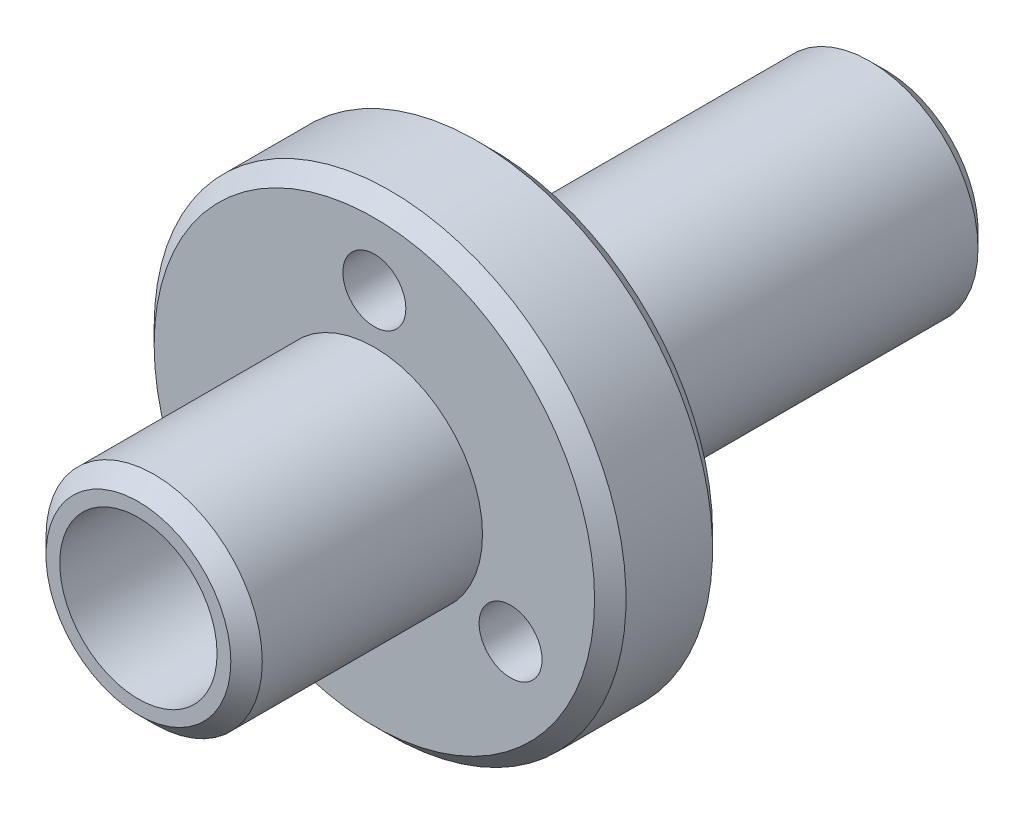
ISO-10303-21;
HEADER;
FILE_DESCRIPTION(('STEP AP214'),'2;1');
FILE_NAME('part.step','',(''),(''),'','','');
FILE_SCHEMA(('AUTOMOTIVE_DESIGN { 1 0 10303 214 1 1 1 1 }'));
ENDSEC;
DATA;
#1=APPLICATION_CONTEXT('core data for automotive mechanical design processes');
#2=APPLICATION_PROTOCOL_DEFINITION('international standard','automotive_design',2000,#1);
#3=PRODUCT_CONTEXT('',#1,'mechanical');
#4=PRODUCT('Part','Part','',(#3));
#5=PRODUCT_RELATED_PRODUCT_CATEGORY('part','',(#4));
#6=PRODUCT_DEFINITION_FORMATION('','',#4);
#7=PRODUCT_DEFINITION_CONTEXT('part definition',#1,'design');
#8=PRODUCT_DEFINITION('design','',#6,#7);
#9=PRODUCT_DEFINITION_SHAPE('','',#8);
#10=(LENGTH_UNIT() NAMED_UNIT(*) SI_UNIT(.MILLI.,.METRE.));
#11=(NAMED_UNIT(*) PLANE_ANGLE_UNIT() SI_UNIT($,.RADIAN.));
#12=(NAMED_UNIT(*) SI_UNIT($,.STERADIAN.) SOLID_ANGLE_UNIT());
#13=UNCERTAINTY_MEASURE_WITH_UNIT(LENGTH_MEASURE(1.E-05),#10,'distance_accuracy_value','');
#14=(GEOMETRIC_REPRESENTATION_CONTEXT(3) GLOBAL_UNCERTAINTY_ASSIGNED_CONTEXT((#13)) GLOBAL_UNIT_ASSIGNED_CONTEXT((#10,
#11,#12)) REPRESENTATION_CONTEXT('',''));
#15=CARTESIAN_POINT('',(0.,0.,0.));
#16=DIRECTION('',(0.,0.,1.));
#17=DIRECTION('',(1.,0.,0.));
#18=AXIS2_PLACEMENT_3D('',#15,#16,#17);
#19=CARTESIAN_POINT('',(-27.5,59.9979166304964,-6.));
#20=DIRECTION('',(0.,0.,1.));
#21=DIRECTION('',(1.,0.,0.));
#22=AXIS2_PLACEMENT_3D('',#19,#20,#21);
#23=CYLINDRICAL_SURFACE('',#22,2.75);
#24=CARTESIAN_POINT('',(-27.5,59.9979166304964,-0.399999999999998));
#25=DIRECTION('',(0.,0.,1.));
#26=DIRECTION('',(1.,0.,0.));
#27=AXIS2_PLACEMENT_3D('',#24,#25,#26);
#28=CIRCLE('',#27,2.75);
#29=CARTESIAN_POINT('',(-24.75,59.9979166304964,-0.399999999999998));
#30=VERTEX_POINT('',#29);
#31=EDGE_CURVE('E66',#30,#30,#28,.F.);
#32=ORIENTED_EDGE('',*,*,#31,.T.);
#33=EDGE_LOOP('',(#32));
#34=FACE_BOUND('',#33,.T.);
#35=CARTESIAN_POINT('',(-27.5,59.9979166304964,-6.));
#36=DIRECTION('',(0.,0.,1.));
#37=DIRECTION('',(1.,0.,0.));
#38=AXIS2_PLACEMENT_3D('',#35,#36,#37);
#39=CIRCLE('',#38,2.75);
#40=CARTESIAN_POINT('',(-24.75,59.9979166304964,-6.));
#41=VERTEX_POINT('',#40);
#42=EDGE_CURVE('E95',#41,#41,#39,.T.);
#43=ORIENTED_EDGE('',*,*,#42,.T.);
#44=EDGE_LOOP('',(#43));
#45=FACE_BOUND('',#44,.T.);
#46=ADVANCED_FACE('F39',(#34,#45),#23,.T.);
#47=CARTESIAN_POINT('',(-27.5,59.9979166304964,0.));
#48=DIRECTION('',(0.,0.,1.));
#49=DIRECTION('',(1.,0.,0.));
#50=AXIS2_PLACEMENT_3D('',#47,#48,#49);
#51=PLANE('',#50);
#52=CARTESIAN_POINT('',(-27.5,59.9979166304964,0.));
#53=DIRECTION('',(0.,0.,1.));
#54=DIRECTION('',(1.,0.,0.));
#55=AXIS2_PLACEMENT_3D('',#52,#53,#54);
#56=CIRCLE('',#55,2.);
#57=CARTESIAN_POINT('',(-25.5,59.9979166304964,0.));
#58=VERTEX_POINT('',#57);
#59=EDGE_CURVE('E109',#58,#58,#56,.T.);
#60=ORIENTED_EDGE('',*,*,#59,.F.);
#61=EDGE_LOOP('',(#60));
#62=FACE_BOUND('',#61,.T.);
#63=CARTESIAN_POINT('',(-27.5,59.9979166304964,0.));
#64=DIRECTION('',(0.,0.,1.));
#65=DIRECTION('',(1.,0.,0.));
#66=AXIS2_PLACEMENT_3D('',#63,#64,#65);
#67=CIRCLE('',#66,2.35);
#68=CARTESIAN_POINT('',(-25.15,59.9979166304964,0.));
#69=VERTEX_POINT('',#68);
#70=EDGE_CURVE('E69',#69,#69,#67,.T.);
#71=ORIENTED_EDGE('',*,*,#70,.T.);
#72=EDGE_LOOP('',(#71));
#73=FACE_BOUND('',#72,.T.);
#74=ADVANCED_FACE('F125',(#62,#73),#51,.T.);
#75=CARTESIAN_POINT('',(-27.5,59.9979166304964,-9.));
#76=DIRECTION('',(0.,0.,1.));
#77=DIRECTION('',(1.,0.,0.));
#78=AXIS2_PLACEMENT_3D('',#75,#76,#77);
#79=CYLINDRICAL_SURFACE('',#78,6.00000000000001);
#80=CARTESIAN_POINT('',(-27.5,59.9979166304964,-6.4));
#81=DIRECTION('',(0.,0.,-1.));
#82=DIRECTION('',(-1.,0.,0.));
#83=AXIS2_PLACEMENT_3D('',#80,#81,#82);
#84=CIRCLE('',#83,6.00000000000001);
#85=CARTESIAN_POINT('',(-33.5,59.9979166304964,-6.4));
#86=VERTEX_POINT('',#85);
#87=EDGE_CURVE('E54',#86,#86,#84,.T.);
#88=ORIENTED_EDGE('',*,*,#87,.T.);
#89=EDGE_LOOP('',(#88));
#90=FACE_BOUND('',#89,.T.);
#91=CARTESIAN_POINT('',(-27.5,59.9979166304964,-8.6));
#92=DIRECTION('',(0.,0.,-1.));
#93=DIRECTION('',(-1.,0.,0.));
#94=AXIS2_PLACEMENT_3D('',#91,#92,#93);
#95=CIRCLE('',#94,6.00000000000001);
#96=CARTESIAN_POINT('',(-33.5,59.9979166304964,-8.6));
#97=VERTEX_POINT('',#96);
#98=EDGE_CURVE('E60',#97,#97,#95,.F.);
#99=ORIENTED_EDGE('',*,*,#98,.T.);
#100=EDGE_LOOP('',(#99));
#101=FACE_BOUND('',#100,.T.);
#102=ADVANCED_FACE('F128',(#90,#101),#79,.T.);
#103=CARTESIAN_POINT('',(-27.5,59.9979166304964,-9.));
#104=DIRECTION('',(0.,0.,-1.));
#105=DIRECTION('',(-1.,0.,0.));
#106=AXIS2_PLACEMENT_3D('',#103,#104,#105);
#107=PLANE('',#106);
#108=CARTESIAN_POINT('',(-27.5,59.9979166304964,-9.));
#109=DIRECTION('',(0.,0.,-1.));
#110=DIRECTION('',(-1.,0.,0.));
#111=AXIS2_PLACEMENT_3D('',#108,#109,#110);
#112=CIRCLE('',#111,5.60000000000001);
#113=CARTESIAN_POINT('',(-33.1,59.9979166304964,-9.));
#114=VERTEX_POINT('',#113);
#115=EDGE_CURVE('E10',#114,#114,#112,.T.);
#116=ORIENTED_EDGE('',*,*,#115,.T.);
#117=EDGE_LOOP('',(#116));
#118=FACE_BOUND('',#117,.T.);
#119=CARTESIAN_POINT('',(-24.0358983848622,57.9979166304964,-9.));
#120=DIRECTION('',(0.,0.,-1.));
#121=DIRECTION('',(-1.,0.,0.));
#122=AXIS2_PLACEMENT_3D('',#119,#120,#121);
#123=CIRCLE('',#122,0.8);
#124=CARTESIAN_POINT('',(-24.8358983848622,57.9979166304964,-9.));
#125=VERTEX_POINT('',#124);
#126=EDGE_CURVE('E81',#125,#125,#123,.T.);
#127=ORIENTED_EDGE('',*,*,#126,.F.);
#128=EDGE_LOOP('',(#127));
#129=FACE_BOUND('',#128,.T.);
#130=CARTESIAN_POINT('',(-30.9641016151378,57.9979166304964,-9.));
#131=DIRECTION('',(0.,0.,-1.));
#132=DIRECTION('',(-1.,0.,0.));
#133=AXIS2_PLACEMENT_3D('',#130,#131,#132);
#134=CIRCLE('',#133,0.8);
#135=CARTESIAN_POINT('',(-31.7641016151378,57.9979166304964,-9.));
#136=VERTEX_POINT('',#135);
#137=EDGE_CURVE('E86',#136,#136,#134,.T.);
#138=ORIENTED_EDGE('',*,*,#137,.F.);
#139=EDGE_LOOP('',(#138));
#140=FACE_BOUND('',#139,.T.);
#141=CARTESIAN_POINT('',(-27.5,63.9979166304964,-9.));
#142=DIRECTION('',(0.,0.,-1.));
#143=DIRECTION('',(-1.,0.,0.));
#144=AXIS2_PLACEMENT_3D('',#141,#142,#143);
#145=CIRCLE('',#144,0.8);
#146=CARTESIAN_POINT('',(-28.3,63.9979166304964,-9.));
#147=VERTEX_POINT('',#146);
#148=EDGE_CURVE('E91',#147,#147,#145,.T.);
#149=ORIENTED_EDGE('',*,*,#148,.F.);
#150=EDGE_LOOP('',(#149));
#151=FACE_BOUND('',#150,.T.);
#152=CARTESIAN_POINT('',(-27.5,59.9979166304964,-9.));
#153=DIRECTION('',(0.,0.,-1.));
#154=DIRECTION('',(-1.,0.,0.));
#155=AXIS2_PLACEMENT_3D('',#152,#153,#154);
#156=CIRCLE('',#155,2.75);
#157=CARTESIAN_POINT('',(-30.25,59.9979166304964,-9.));
#158=VERTEX_POINT('',#157);
#159=EDGE_CURVE('E80',#158,#158,#156,.T.);
#160=ORIENTED_EDGE('',*,*,#159,.F.);
#161=EDGE_LOOP('',(#160));
#162=FACE_BOUND('',#161,.T.);
#163=ADVANCED_FACE('F156',(#118,#129,#140,#151,#162),#107,.T.);
#164=CARTESIAN_POINT('',(-27.5,59.9979166304964,-6.));
#165=DIRECTION('',(0.,0.,-1.));
#166=DIRECTION('',(-1.,0.,0.));
#167=AXIS2_PLACEMENT_3D('',#164,#165,#166);
#168=PLANE('',#167);
#169=CARTESIAN_POINT('',(-27.5,59.9979166304964,-6.));
#170=DIRECTION('',(0.,0.,-1.));
#171=DIRECTION('',(-1.,0.,0.));
#172=AXIS2_PLACEMENT_3D('',#169,#170,#171);
#173=CIRCLE('',#172,5.60000000000001);
#174=CARTESIAN_POINT('',(-33.1,59.9979166304964,-6.));
#175=VERTEX_POINT('',#174);
#176=EDGE_CURVE('E47',#175,#175,#173,.F.);
#177=ORIENTED_EDGE('',*,*,#176,.T.);
#178=EDGE_LOOP('',(#177));
#179=FACE_BOUND('',#178,.T.);
#180=CARTESIAN_POINT('',(-24.0358983848622,57.9979166304964,-6.));
#181=DIRECTION('',(0.,0.,1.));
#182=DIRECTION('',(1.,0.,0.));
#183=AXIS2_PLACEMENT_3D('',#180,#181,#182);
#184=CIRCLE('',#183,0.800000000000002);
#185=CARTESIAN_POINT('',(-23.2358983848622,57.9979166304964,-6.));
#186=VERTEX_POINT('',#185);
#187=EDGE_CURVE('E85',#186,#186,#184,.T.);
#188=ORIENTED_EDGE('',*,*,#187,.F.);
#189=EDGE_LOOP('',(#188));
#190=FACE_BOUND('',#189,.T.);
#191=CARTESIAN_POINT('',(-30.9641016151378,57.9979166304964,-6.));
#192=DIRECTION('',(0.,0.,1.));
#193=DIRECTION('',(1.,0.,0.));
#194=AXIS2_PLACEMENT_3D('',#191,#192,#193);
#195=CIRCLE('',#194,0.800000000000002);
#196=CARTESIAN_POINT('',(-30.1641016151378,57.9979166304964,-6.));
#197=VERTEX_POINT('',#196);
#198=EDGE_CURVE('E84',#197,#197,#195,.T.);
#199=ORIENTED_EDGE('',*,*,#198,.F.);
#200=EDGE_LOOP('',(#199));
#201=FACE_BOUND('',#200,.T.);
#202=CARTESIAN_POINT('',(-27.5,63.9979166304964,-6.));
#203=DIRECTION('',(0.,0.,1.));
#204=DIRECTION('',(1.,0.,0.));
#205=AXIS2_PLACEMENT_3D('',#202,#203,#204);
#206=CIRCLE('',#205,0.800000000000002);
#207=CARTESIAN_POINT('',(-26.7,63.9979166304964,-6.));
#208=VERTEX_POINT('',#207);
#209=EDGE_CURVE('E90',#208,#208,#206,.T.);
#210=ORIENTED_EDGE('',*,*,#209,.F.);
#211=EDGE_LOOP('',(#210));
#212=FACE_BOUND('',#211,.T.);
#213=ORIENTED_EDGE('',*,*,#42,.F.);
#214=EDGE_LOOP('',(#213));
#215=FACE_BOUND('',#214,.T.);
#216=ADVANCED_FACE('F158',(#179,#190,#201,#212,#215),#168,.F.);
#217=CARTESIAN_POINT('',(-27.5,59.9979166304964,-19.));
#218=DIRECTION('',(0.,0.,1.));
#219=DIRECTION('',(1.,0.,0.));
#220=AXIS2_PLACEMENT_3D('',#217,#218,#219);
#221=CYLINDRICAL_SURFACE('',#220,2.75);
#222=CARTESIAN_POINT('',(-27.5,59.9979166304964,-18.6));
#223=DIRECTION('',(0.,0.,-1.));
#224=DIRECTION('',(-1.,0.,0.));
#225=AXIS2_PLACEMENT_3D('',#222,#223,#224);
#226=CIRCLE('',#225,2.75);
#227=CARTESIAN_POINT('',(-30.25,59.9979166304964,-18.6));
#228=VERTEX_POINT('',#227);
#229=EDGE_CURVE('E72',#228,#228,#226,.F.);
#230=ORIENTED_EDGE('',*,*,#229,.T.);
#231=EDGE_LOOP('',(#230));
#232=FACE_BOUND('',#231,.T.);
#233=ORIENTED_EDGE('',*,*,#159,.T.);
#234=EDGE_LOOP('',(#233));
#235=FACE_BOUND('',#234,.T.);
#236=ADVANCED_FACE('F161',(#232,#235),#221,.T.);
#237=CARTESIAN_POINT('',(-27.5,59.9979166304964,-19.));
#238=DIRECTION('',(0.,0.,-1.));
#239=DIRECTION('',(-1.,0.,0.));
#240=AXIS2_PLACEMENT_3D('',#237,#238,#239);
#241=PLANE('',#240);
#242=CARTESIAN_POINT('',(-27.5,59.9979166304964,-19.));
#243=DIRECTION('',(0.,0.,1.));
#244=DIRECTION('',(1.,0.,0.));
#245=AXIS2_PLACEMENT_3D('',#242,#243,#244);
#246=CIRCLE('',#245,2.);
#247=CARTESIAN_POINT('',(-25.5,59.9979166304964,-19.));
#248=VERTEX_POINT('',#247);
#249=EDGE_CURVE('E108',#248,#248,#246,.T.);
#250=ORIENTED_EDGE('',*,*,#249,.T.);
#251=EDGE_LOOP('',(#250));
#252=FACE_BOUND('',#251,.T.);
#253=CARTESIAN_POINT('',(-27.5,59.9979166304964,-19.));
#254=DIRECTION('',(0.,0.,-1.));
#255=DIRECTION('',(-1.,0.,0.));
#256=AXIS2_PLACEMENT_3D('',#253,#254,#255);
#257=CIRCLE('',#256,2.35);
#258=CARTESIAN_POINT('',(-29.85,59.9979166304964,-19.));
#259=VERTEX_POINT('',#258);
#260=EDGE_CURVE('E76',#259,#259,#257,.T.);
#261=ORIENTED_EDGE('',*,*,#260,.T.);
#262=EDGE_LOOP('',(#261));
#263=FACE_BOUND('',#262,.T.);
#264=ADVANCED_FACE('F116',(#252,#263),#241,.T.);
#265=CARTESIAN_POINT('',(-27.5,63.9979166304964,-6.));
#266=DIRECTION('',(0.,0.,1.));
#267=DIRECTION('',(1.,0.,0.));
#268=AXIS2_PLACEMENT_3D('',#265,#266,#267);
#269=CYLINDRICAL_SURFACE('',#268,0.8);
#270=ORIENTED_EDGE('',*,*,#148,.T.);
#271=EDGE_LOOP('',(#270));
#272=FACE_BOUND('',#271,.T.);
#273=ORIENTED_EDGE('',*,*,#209,.T.);
#274=EDGE_LOOP('',(#273));
#275=FACE_BOUND('',#274,.T.);
#276=ADVANCED_FACE('F169',(#272,#275),#269,.F.);
#277=CARTESIAN_POINT('',(-30.9641016151378,57.9979166304964,-6.));
#278=DIRECTION('',(0.,0.,1.));
#279=DIRECTION('',(1.,0.,0.));
#280=AXIS2_PLACEMENT_3D('',#277,#278,#279);
#281=CYLINDRICAL_SURFACE('',#280,0.8);
#282=ORIENTED_EDGE('',*,*,#137,.T.);
#283=EDGE_LOOP('',(#282));
#284=FACE_BOUND('',#283,.T.);
#285=ORIENTED_EDGE('',*,*,#198,.T.);
#286=EDGE_LOOP('',(#285));
#287=FACE_BOUND('',#286,.T.);
#288=ADVANCED_FACE('F172',(#284,#287),#281,.F.);
#289=CARTESIAN_POINT('',(-24.0358983848622,57.9979166304964,-6.));
#290=DIRECTION('',(0.,0.,1.));
#291=DIRECTION('',(1.,0.,0.));
#292=AXIS2_PLACEMENT_3D('',#289,#290,#291);
#293=CYLINDRICAL_SURFACE('',#292,0.8);
#294=ORIENTED_EDGE('',*,*,#126,.T.);
#295=EDGE_LOOP('',(#294));
#296=FACE_BOUND('',#295,.T.);
#297=ORIENTED_EDGE('',*,*,#187,.T.);
#298=EDGE_LOOP('',(#297));
#299=FACE_BOUND('',#298,.T.);
#300=ADVANCED_FACE('F143',(#296,#299),#293,.F.);
#301=CARTESIAN_POINT('',(-27.5,59.9979166304964,-19.));
#302=DIRECTION('',(0.,0.,1.));
#303=DIRECTION('',(1.,0.,0.));
#304=AXIS2_PLACEMENT_3D('',#301,#302,#303);
#305=CONICAL_SURFACE('',#304,2.35,0.785398163397452);
#306=ORIENTED_EDGE('',*,*,#229,.F.);
#307=EDGE_LOOP('',(#306));
#308=FACE_BOUND('',#307,.T.);
#309=ORIENTED_EDGE('',*,*,#260,.F.);
#310=EDGE_LOOP('',(#309));
#311=FACE_BOUND('',#310,.T.);
#312=ADVANCED_FACE('F135',(#308,#311),#305,.T.);
#313=CARTESIAN_POINT('',(-27.5,59.9979166304964,0.));
#314=DIRECTION('',(0.,0.,-1.));
#315=DIRECTION('',(-1.,0.,0.));
#316=AXIS2_PLACEMENT_3D('',#313,#314,#315);
#317=CONICAL_SURFACE('',#316,2.35,0.785398163397447);
#318=ORIENTED_EDGE('',*,*,#31,.F.);
#319=EDGE_LOOP('',(#318));
#320=FACE_BOUND('',#319,.T.);
#321=ORIENTED_EDGE('',*,*,#70,.F.);
#322=EDGE_LOOP('',(#321));
#323=FACE_BOUND('',#322,.T.);
#324=ADVANCED_FACE('F132',(#320,#323),#317,.T.);
#325=CARTESIAN_POINT('',(-27.5,59.9979166304964,-6.4));
#326=DIRECTION('',(0.,0.,-1.));
#327=DIRECTION('',(-1.,0.,0.));
#328=AXIS2_PLACEMENT_3D('',#325,#326,#327);
#329=CONICAL_SURFACE('',#328,6.00000000000001,0.785398163397449);
#330=ORIENTED_EDGE('',*,*,#176,.F.);
#331=EDGE_LOOP('',(#330));
#332=FACE_BOUND('',#331,.T.);
#333=ORIENTED_EDGE('',*,*,#87,.F.);
#334=EDGE_LOOP('',(#333));
#335=FACE_BOUND('',#334,.T.);
#336=ADVANCED_FACE('F134',(#332,#335),#329,.T.);
#337=CARTESIAN_POINT('',(-27.5,59.9979166304964,-9.));
#338=DIRECTION('',(0.,0.,1.));
#339=DIRECTION('',(1.,0.,0.));
#340=AXIS2_PLACEMENT_3D('',#337,#338,#339);
#341=CONICAL_SURFACE('',#340,5.60000000000001,0.785398163397447);
#342=ORIENTED_EDGE('',*,*,#98,.F.);
#343=EDGE_LOOP('',(#342));
#344=FACE_BOUND('',#343,.T.);
#345=ORIENTED_EDGE('',*,*,#115,.F.);
#346=EDGE_LOOP('',(#345));
#347=FACE_BOUND('',#346,.T.);
#348=ADVANCED_FACE('F41',(#344,#347),#341,.T.);
#349=CARTESIAN_POINT('',(-27.5,59.9979166304964,-19.));
#350=DIRECTION('',(0.,0.,1.));
#351=DIRECTION('',(1.,0.,0.));
#352=AXIS2_PLACEMENT_3D('',#349,#350,#351);
#353=CYLINDRICAL_SURFACE('',#352,2.);
#354=ORIENTED_EDGE('',*,*,#249,.F.);
#355=EDGE_LOOP('',(#354));
#356=FACE_BOUND('',#355,.T.);
#357=ORIENTED_EDGE('',*,*,#59,.T.);
#358=EDGE_LOOP('',(#357));
#359=FACE_BOUND('',#358,.T.);
#360=ADVANCED_FACE('F119',(#356,#359),#353,.F.);
#361=CLOSED_SHELL('',(#46,#74,#102,#163,#216,#236,#264,#276,#288,#300,#312,#324,#336,#348,#360));
#362=MANIFOLD_SOLID_BREP('B2',#361);
#363=ADVANCED_BREP_SHAPE_REPRESENTATION('',(#18,#362),#14);
#364=SHAPE_DEFINITION_REPRESENTATION(#9,#363);
ENDSEC;
END-ISO-10303-21;
